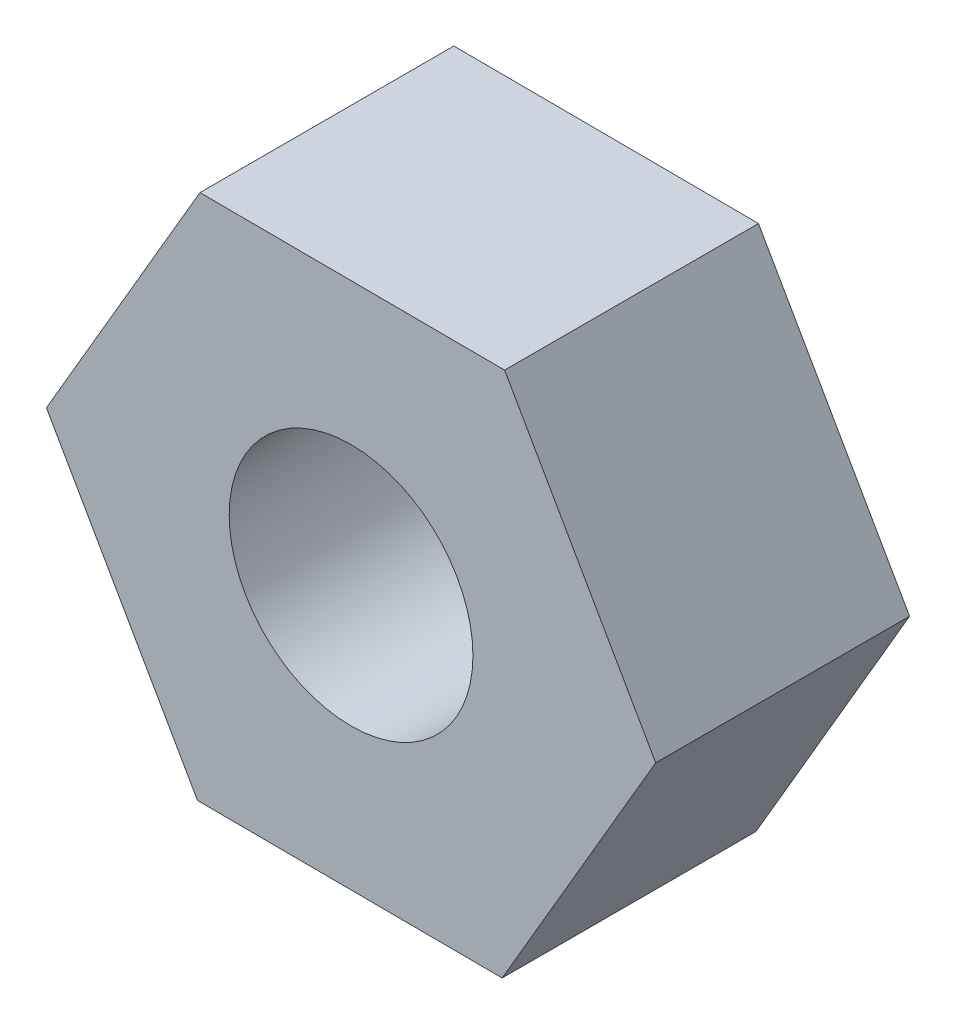
ISO-10303-21;
HEADER;
FILE_DESCRIPTION(('STEP AP214'),'2;1');
FILE_NAME('part.step','',(''),(''),'','','');
FILE_SCHEMA(('AUTOMOTIVE_DESIGN { 1 0 10303 214 1 1 1 1 }'));
ENDSEC;
DATA;
#1=APPLICATION_CONTEXT('core data for automotive mechanical design processes');
#2=APPLICATION_PROTOCOL_DEFINITION('international standard','automotive_design',2000,#1);
#3=PRODUCT_CONTEXT('',#1,'mechanical');
#4=PRODUCT('Part','Part','',(#3));
#5=PRODUCT_RELATED_PRODUCT_CATEGORY('part','',(#4));
#6=PRODUCT_DEFINITION_FORMATION('','',#4);
#7=PRODUCT_DEFINITION_CONTEXT('part definition',#1,'design');
#8=PRODUCT_DEFINITION('design','',#6,#7);
#9=PRODUCT_DEFINITION_SHAPE('','',#8);
#10=(LENGTH_UNIT() NAMED_UNIT(*) SI_UNIT(.MILLI.,.METRE.));
#11=(NAMED_UNIT(*) PLANE_ANGLE_UNIT() SI_UNIT($,.RADIAN.));
#12=(NAMED_UNIT(*) SI_UNIT($,.STERADIAN.) SOLID_ANGLE_UNIT());
#13=UNCERTAINTY_MEASURE_WITH_UNIT(LENGTH_MEASURE(1.E-05),#10,'distance_accuracy_value','');
#14=(GEOMETRIC_REPRESENTATION_CONTEXT(3) GLOBAL_UNCERTAINTY_ASSIGNED_CONTEXT((#13)) GLOBAL_UNIT_ASSIGNED_CONTEXT((#10,
#11,#12)) REPRESENTATION_CONTEXT('',''));
#15=CARTESIAN_POINT('',(0.,0.,0.));
#16=DIRECTION('',(0.,0.,1.));
#17=DIRECTION('',(1.,0.,0.));
#18=AXIS2_PLACEMENT_3D('',#15,#16,#17);
#19=CARTESIAN_POINT('',(0.,0.,5.));
#20=DIRECTION('',(0.,0.,1.));
#21=DIRECTION('',(1.,0.,0.));
#22=AXIS2_PLACEMENT_3D('',#19,#20,#21);
#23=PLANE('',#22);
#24=DIRECTION('',(-0.999989108419823,0.00466723062721316,0.));
#25=VECTOR('',#24,1.);
#26=CARTESIAN_POINT('',(3.0242519058725,5.18215057832278,5.));
#27=LINE('',#26,#25);
#28=CARTESIAN_POINT('',(3.0242519058725,5.18215057832278,5.));
#29=VERTEX_POINT('',#28);
#30=CARTESIAN_POINT('',(-2.9757480941275,5.21015426709048,5.));
#31=VERTEX_POINT('',#30);
#32=EDGE_CURVE('E130',#29,#31,#27,.T.);
#33=ORIENTED_EDGE('',*,*,#32,.T.);
#34=DIRECTION('',(-0.504036494498399,-0.863682356085711,0.));
#35=VECTOR('',#34,1.);
#36=CARTESIAN_POINT('',(-2.9757480941275,5.21015426709048,5.));
#37=LINE('',#36,#35);
#38=CARTESIAN_POINT('',(-6.,0.0280036887677007,5.));
#39=VERTEX_POINT('',#38);
#40=EDGE_CURVE('E88',#31,#39,#37,.T.);
#41=ORIENTED_EDGE('',*,*,#40,.T.);
#42=DIRECTION('',(0.495952613921424,-0.868349586712925,0.));
#43=VECTOR('',#42,1.);
#44=CARTESIAN_POINT('',(-6.,0.0280036887677007,5.));
#45=LINE('',#44,#43);
#46=CARTESIAN_POINT('',(-3.0242519058725,-5.18215057832278,5.));
#47=VERTEX_POINT('',#46);
#48=EDGE_CURVE('E101',#39,#47,#45,.T.);
#49=ORIENTED_EDGE('',*,*,#48,.T.);
#50=DIRECTION('',(0.999989108419823,-0.00466723062721344,0.));
#51=VECTOR('',#50,1.);
#52=CARTESIAN_POINT('',(-3.0242519058725,-5.18215057832278,5.));
#53=LINE('',#52,#51);
#54=CARTESIAN_POINT('',(2.9757480941275,-5.21015426709048,5.));
#55=VERTEX_POINT('',#54);
#56=EDGE_CURVE('E95',#47,#55,#53,.T.);
#57=ORIENTED_EDGE('',*,*,#56,.T.);
#58=DIRECTION('',(0.504036494498399,0.863682356085711,0.));
#59=VECTOR('',#58,1.);
#60=CARTESIAN_POINT('',(2.9757480941275,-5.21015426709048,5.));
#61=LINE('',#60,#59);
#62=CARTESIAN_POINT('',(6.,-0.028003688767703,5.));
#63=VERTEX_POINT('',#62);
#64=EDGE_CURVE('E99',#55,#63,#61,.T.);
#65=ORIENTED_EDGE('',*,*,#64,.T.);
#66=DIRECTION('',(-0.495952613921424,0.868349586712925,0.));
#67=VECTOR('',#66,1.);
#68=CARTESIAN_POINT('',(6.,-0.028003688767703,5.));
#69=LINE('',#68,#67);
#70=EDGE_CURVE('E51',#63,#29,#69,.T.);
#71=ORIENTED_EDGE('',*,*,#70,.T.);
#72=EDGE_LOOP('',(#33,#41,#49,#57,#65,#71));
#73=FACE_BOUND('',#72,.T.);
#74=CARTESIAN_POINT('',(0.,0.,5.));
#75=DIRECTION('',(0.,0.,1.));
#76=DIRECTION('',(1.,0.,0.));
#77=AXIS2_PLACEMENT_3D('',#74,#75,#76);
#78=CIRCLE('',#77,2.4);
#79=CARTESIAN_POINT('',(2.4,0.,5.));
#80=VERTEX_POINT('',#79);
#81=EDGE_CURVE('E123',#80,#80,#78,.T.);
#82=ORIENTED_EDGE('',*,*,#81,.F.);
#83=EDGE_LOOP('',(#82));
#84=FACE_BOUND('',#83,.T.);
#85=ADVANCED_FACE('F34',(#73,#84),#23,.T.);
#86=CARTESIAN_POINT('',(0.,0.,0.));
#87=DIRECTION('',(0.,0.,1.));
#88=DIRECTION('',(1.,0.,0.));
#89=AXIS2_PLACEMENT_3D('',#86,#87,#88);
#90=PLANE('',#89);
#91=DIRECTION('',(-0.999989108419823,0.00466723062721316,0.));
#92=VECTOR('',#91,1.);
#93=CARTESIAN_POINT('',(3.0242519058725,5.18215057832278,0.));
#94=LINE('',#93,#92);
#95=CARTESIAN_POINT('',(3.0242519058725,5.18215057832278,0.));
#96=VERTEX_POINT('',#95);
#97=CARTESIAN_POINT('',(-2.9757480941275,5.21015426709048,0.));
#98=VERTEX_POINT('',#97);
#99=EDGE_CURVE('E119',#96,#98,#94,.T.);
#100=ORIENTED_EDGE('',*,*,#99,.F.);
#101=DIRECTION('',(-0.495952613921424,0.868349586712925,0.));
#102=VECTOR('',#101,1.);
#103=CARTESIAN_POINT('',(6.,-0.028003688767703,0.));
#104=LINE('',#103,#102);
#105=CARTESIAN_POINT('',(6.,-0.028003688767703,0.));
#106=VERTEX_POINT('',#105);
#107=EDGE_CURVE('E80',#106,#96,#104,.T.);
#108=ORIENTED_EDGE('',*,*,#107,.F.);
#109=DIRECTION('',(0.504036494498399,0.863682356085711,0.));
#110=VECTOR('',#109,1.);
#111=CARTESIAN_POINT('',(2.9757480941275,-5.21015426709048,0.));
#112=LINE('',#111,#110);
#113=CARTESIAN_POINT('',(2.9757480941275,-5.21015426709048,0.));
#114=VERTEX_POINT('',#113);
#115=EDGE_CURVE('E74',#114,#106,#112,.T.);
#116=ORIENTED_EDGE('',*,*,#115,.F.);
#117=DIRECTION('',(0.999989108419823,-0.00466723062721344,0.));
#118=VECTOR('',#117,1.);
#119=CARTESIAN_POINT('',(-3.0242519058725,-5.18215057832278,0.));
#120=LINE('',#119,#118);
#121=CARTESIAN_POINT('',(-3.0242519058725,-5.18215057832278,0.));
#122=VERTEX_POINT('',#121);
#123=EDGE_CURVE('E109',#122,#114,#120,.T.);
#124=ORIENTED_EDGE('',*,*,#123,.F.);
#125=DIRECTION('',(0.495952613921424,-0.868349586712925,0.));
#126=VECTOR('',#125,1.);
#127=CARTESIAN_POINT('',(-6.,0.0280036887677007,0.));
#128=LINE('',#127,#126);
#129=CARTESIAN_POINT('',(-6.,0.0280036887677007,0.));
#130=VERTEX_POINT('',#129);
#131=EDGE_CURVE('E125',#130,#122,#128,.T.);
#132=ORIENTED_EDGE('',*,*,#131,.F.);
#133=DIRECTION('',(-0.504036494498399,-0.863682356085711,0.));
#134=VECTOR('',#133,1.);
#135=CARTESIAN_POINT('',(-2.9757480941275,5.21015426709048,0.));
#136=LINE('',#135,#134);
#137=EDGE_CURVE('E122',#98,#130,#136,.T.);
#138=ORIENTED_EDGE('',*,*,#137,.F.);
#139=EDGE_LOOP('',(#100,#108,#116,#124,#132,#138));
#140=FACE_BOUND('',#139,.T.);
#141=CARTESIAN_POINT('',(0.,0.,0.));
#142=DIRECTION('',(0.,0.,1.));
#143=DIRECTION('',(1.,0.,0.));
#144=AXIS2_PLACEMENT_3D('',#141,#142,#143);
#145=CIRCLE('',#144,2.4);
#146=CARTESIAN_POINT('',(2.4,0.,0.));
#147=VERTEX_POINT('',#146);
#148=EDGE_CURVE('E223',#147,#147,#145,.T.);
#149=ORIENTED_EDGE('',*,*,#148,.T.);
#150=EDGE_LOOP('',(#149));
#151=FACE_BOUND('',#150,.T.);
#152=ADVANCED_FACE('F139',(#140,#151),#90,.F.);
#153=CARTESIAN_POINT('',(3.0242519058725,5.18215057832278,5.));
#154=DIRECTION('',(-0.00466723062721316,-0.999989108419823,0.));
#155=DIRECTION('',(0.999989108419823,-0.00466723062721316,0.));
#156=AXIS2_PLACEMENT_3D('',#153,#154,#155);
#157=PLANE('',#156);
#158=ORIENTED_EDGE('',*,*,#99,.T.);
#159=DIRECTION('',(0.,0.,-1.));
#160=VECTOR('',#159,1.);
#161=CARTESIAN_POINT('',(-2.9757480941275,5.21015426709048,5.));
#162=LINE('',#161,#160);
#163=EDGE_CURVE('E11',#31,#98,#162,.T.);
#164=ORIENTED_EDGE('',*,*,#163,.F.);
#165=ORIENTED_EDGE('',*,*,#32,.F.);
#166=DIRECTION('',(0.,0.,-1.));
#167=VECTOR('',#166,1.);
#168=CARTESIAN_POINT('',(3.0242519058725,5.18215057832278,5.));
#169=LINE('',#168,#167);
#170=EDGE_CURVE('E115',#29,#96,#169,.T.);
#171=ORIENTED_EDGE('',*,*,#170,.T.);
#172=EDGE_LOOP('',(#158,#164,#165,#171));
#173=FACE_BOUND('',#172,.T.);
#174=ADVANCED_FACE('F36',(#173),#157,.F.);
#175=CARTESIAN_POINT('',(-2.9757480941275,5.21015426709048,5.));
#176=DIRECTION('',(0.863682356085711,-0.504036494498399,0.));
#177=DIRECTION('',(0.504036494498399,0.863682356085711,0.));
#178=AXIS2_PLACEMENT_3D('',#175,#176,#177);
#179=PLANE('',#178);
#180=ORIENTED_EDGE('',*,*,#137,.T.);
#181=DIRECTION('',(0.,0.,-1.));
#182=VECTOR('',#181,1.);
#183=CARTESIAN_POINT('',(-6.,0.0280036887677007,5.));
#184=LINE('',#183,#182);
#185=EDGE_CURVE('E43',#39,#130,#184,.T.);
#186=ORIENTED_EDGE('',*,*,#185,.F.);
#187=ORIENTED_EDGE('',*,*,#40,.F.);
#188=ORIENTED_EDGE('',*,*,#163,.T.);
#189=EDGE_LOOP('',(#180,#186,#187,#188));
#190=FACE_BOUND('',#189,.T.);
#191=ADVANCED_FACE('F164',(#190),#179,.F.);
#192=CARTESIAN_POINT('',(-6.,0.0280036887677007,5.));
#193=DIRECTION('',(0.868349586712925,0.495952613921424,0.));
#194=DIRECTION('',(-0.495952613921424,0.868349586712925,0.));
#195=AXIS2_PLACEMENT_3D('',#192,#193,#194);
#196=PLANE('',#195);
#197=ORIENTED_EDGE('',*,*,#131,.T.);
#198=DIRECTION('',(0.,0.,-1.));
#199=VECTOR('',#198,1.);
#200=CARTESIAN_POINT('',(-3.0242519058725,-5.18215057832278,5.));
#201=LINE('',#200,#199);
#202=EDGE_CURVE('E110',#47,#122,#201,.T.);
#203=ORIENTED_EDGE('',*,*,#202,.F.);
#204=ORIENTED_EDGE('',*,*,#48,.F.);
#205=ORIENTED_EDGE('',*,*,#185,.T.);
#206=EDGE_LOOP('',(#197,#203,#204,#205));
#207=FACE_BOUND('',#206,.T.);
#208=ADVANCED_FACE('F136',(#207),#196,.F.);
#209=CARTESIAN_POINT('',(-3.0242519058725,-5.18215057832278,5.));
#210=DIRECTION('',(0.00466723062721344,0.999989108419823,0.));
#211=DIRECTION('',(-0.999989108419823,0.00466723062721344,0.));
#212=AXIS2_PLACEMENT_3D('',#209,#210,#211);
#213=PLANE('',#212);
#214=ORIENTED_EDGE('',*,*,#123,.T.);
#215=DIRECTION('',(0.,0.,-1.));
#216=VECTOR('',#215,1.);
#217=CARTESIAN_POINT('',(2.9757480941275,-5.21015426709048,5.));
#218=LINE('',#217,#216);
#219=EDGE_CURVE('E106',#55,#114,#218,.T.);
#220=ORIENTED_EDGE('',*,*,#219,.F.);
#221=ORIENTED_EDGE('',*,*,#56,.F.);
#222=ORIENTED_EDGE('',*,*,#202,.T.);
#223=EDGE_LOOP('',(#214,#220,#221,#222));
#224=FACE_BOUND('',#223,.T.);
#225=ADVANCED_FACE('F107',(#224),#213,.F.);
#226=CARTESIAN_POINT('',(2.9757480941275,-5.21015426709048,5.));
#227=DIRECTION('',(-0.863682356085711,0.504036494498399,0.));
#228=DIRECTION('',(-0.504036494498399,-0.863682356085711,0.));
#229=AXIS2_PLACEMENT_3D('',#226,#227,#228);
#230=PLANE('',#229);
#231=ORIENTED_EDGE('',*,*,#115,.T.);
#232=DIRECTION('',(0.,0.,-1.));
#233=VECTOR('',#232,1.);
#234=CARTESIAN_POINT('',(6.,-0.028003688767703,5.));
#235=LINE('',#234,#233);
#236=EDGE_CURVE('E111',#63,#106,#235,.T.);
#237=ORIENTED_EDGE('',*,*,#236,.F.);
#238=ORIENTED_EDGE('',*,*,#64,.F.);
#239=ORIENTED_EDGE('',*,*,#219,.T.);
#240=EDGE_LOOP('',(#231,#237,#238,#239));
#241=FACE_BOUND('',#240,.T.);
#242=ADVANCED_FACE('F113',(#241),#230,.F.);
#243=CARTESIAN_POINT('',(6.,-0.028003688767703,5.));
#244=DIRECTION('',(-0.868349586712925,-0.495952613921424,0.));
#245=DIRECTION('',(0.495952613921424,-0.868349586712925,0.));
#246=AXIS2_PLACEMENT_3D('',#243,#244,#245);
#247=PLANE('',#246);
#248=ORIENTED_EDGE('',*,*,#107,.T.);
#249=ORIENTED_EDGE('',*,*,#170,.F.);
#250=ORIENTED_EDGE('',*,*,#70,.F.);
#251=ORIENTED_EDGE('',*,*,#236,.T.);
#252=EDGE_LOOP('',(#248,#249,#250,#251));
#253=FACE_BOUND('',#252,.T.);
#254=ADVANCED_FACE('F144',(#253),#247,.F.);
#255=CARTESIAN_POINT('',(0.,0.,5.));
#256=DIRECTION('',(0.,0.,-1.));
#257=DIRECTION('',(-1.,0.,0.));
#258=AXIS2_PLACEMENT_3D('',#255,#256,#257);
#259=CYLINDRICAL_SURFACE('',#258,2.4);
#260=ORIENTED_EDGE('',*,*,#81,.T.);
#261=EDGE_LOOP('',(#260));
#262=FACE_BOUND('',#261,.T.);
#263=ORIENTED_EDGE('',*,*,#148,.F.);
#264=EDGE_LOOP('',(#263));
#265=FACE_BOUND('',#264,.T.);
#266=ADVANCED_FACE('F146',(#262,#265),#259,.F.);
#267=CLOSED_SHELL('',(#85,#152,#174,#191,#208,#225,#242,#254,#266));
#268=MANIFOLD_SOLID_BREP('B2',#267);
#269=ADVANCED_BREP_SHAPE_REPRESENTATION('',(#18,#268),#14);
#270=SHAPE_DEFINITION_REPRESENTATION(#9,#269);
ENDSEC;
END-ISO-10303-21;
